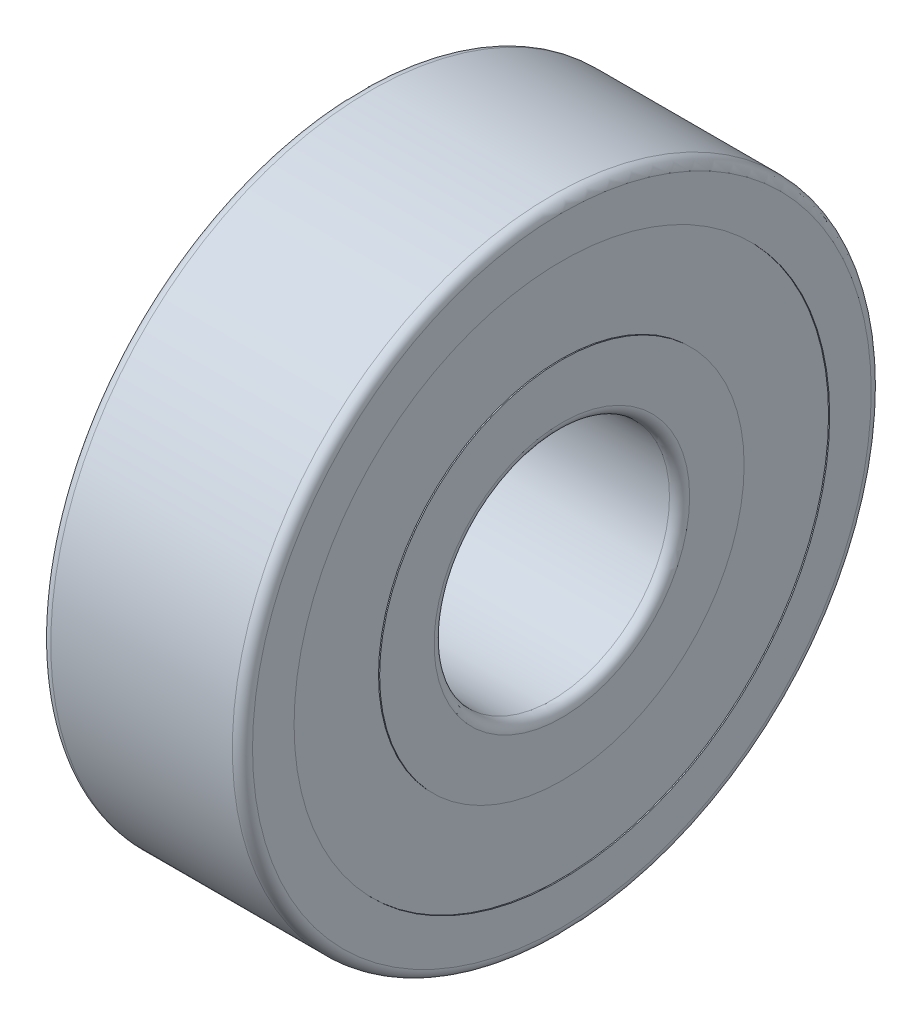
ISO-10303-21;
HEADER;
FILE_DESCRIPTION(('STEP AP214'),'2;1');
FILE_NAME('part.step','',(''),(''),'','','');
FILE_SCHEMA(('AUTOMOTIVE_DESIGN { 1 0 10303 214 1 1 1 1 }'));
ENDSEC;
DATA;
#1=APPLICATION_CONTEXT('core data for automotive mechanical design processes');
#2=APPLICATION_PROTOCOL_DEFINITION('international standard','automotive_design',2000,#1);
#3=PRODUCT_CONTEXT('',#1,'mechanical');
#4=PRODUCT('Part','Part','',(#3));
#5=PRODUCT_RELATED_PRODUCT_CATEGORY('part','',(#4));
#6=PRODUCT_DEFINITION_FORMATION('','',#4);
#7=PRODUCT_DEFINITION_CONTEXT('part definition',#1,'design');
#8=PRODUCT_DEFINITION('design','',#6,#7);
#9=PRODUCT_DEFINITION_SHAPE('','',#8);
#10=(LENGTH_UNIT() NAMED_UNIT(*) SI_UNIT(.MILLI.,.METRE.));
#11=(NAMED_UNIT(*) PLANE_ANGLE_UNIT() SI_UNIT($,.RADIAN.));
#12=(NAMED_UNIT(*) SI_UNIT($,.STERADIAN.) SOLID_ANGLE_UNIT());
#13=UNCERTAINTY_MEASURE_WITH_UNIT(LENGTH_MEASURE(1.E-05),#10,'distance_accuracy_value','');
#14=(GEOMETRIC_REPRESENTATION_CONTEXT(3) GLOBAL_UNCERTAINTY_ASSIGNED_CONTEXT((#13)) GLOBAL_UNIT_ASSIGNED_CONTEXT((#10,
#11,#12)) REPRESENTATION_CONTEXT('',''));
#15=CARTESIAN_POINT('',(0.,0.,0.));
#16=DIRECTION('',(0.,0.,1.));
#17=DIRECTION('',(1.,0.,0.));
#18=AXIS2_PLACEMENT_3D('',#15,#16,#17);
#19=CARTESIAN_POINT('',(3.,4.052683712082,-5.081904636042));
#20=DIRECTION('',(-1.,0.,0.));
#21=DIRECTION('',(0.,1.,0.));
#22=AXIS2_PLACEMENT_3D('',#19,#20,#21);
#23=SPHERICAL_SURFACE('',#22,1.776);
#24=CARTESIAN_POINT('',(4.776,4.052683712082,-5.081904636042));
#25=VERTEX_POINT('',#24);
#26=VERTEX_LOOP('',#25);
#27=FACE_BOUND('',#26,.T.);
#28=ADVANCED_FACE('P0_F15',(#27),#23,.T.);
#29=CLOSED_SHELL('',(#28));
#30=MANIFOLD_SOLID_BREP('P0_B1',#29);
#31=CARTESIAN_POINT('',(3.,-1.446386070716,-6.337031429182));
#32=DIRECTION('',(-1.,0.,0.));
#33=DIRECTION('',(0.,1.,0.));
#34=AXIS2_PLACEMENT_3D('',#31,#32,#33);
#35=SPHERICAL_SURFACE('',#34,1.776);
#36=CARTESIAN_POINT('',(4.776,-1.446386070716,-6.337031429182));
#37=VERTEX_POINT('',#36);
#38=VERTEX_LOOP('',#37);
#39=FACE_BOUND('',#38,.T.);
#40=ADVANCED_FACE('P1_F15',(#39),#35,.T.);
#41=CLOSED_SHELL('',(#40));
#42=MANIFOLD_SOLID_BREP('P1_B1',#41);
#43=CARTESIAN_POINT('',(3.,-5.856297641366,-2.820244304264));
#44=DIRECTION('',(-1.,0.,0.));
#45=DIRECTION('',(0.,1.,0.));
#46=AXIS2_PLACEMENT_3D('',#43,#44,#45);
#47=SPHERICAL_SURFACE('',#46,1.776);
#48=CARTESIAN_POINT('',(4.776,-5.856297641366,-2.820244304264));
#49=VERTEX_POINT('',#48);
#50=VERTEX_LOOP('',#49);
#51=FACE_BOUND('',#50,.T.);
#52=ADVANCED_FACE('P2_F15',(#51),#47,.T.);
#53=CLOSED_SHELL('',(#52));
#54=MANIFOLD_SOLID_BREP('P2_B1',#53);
#55=CARTESIAN_POINT('',(3.,-5.856297641366,2.820244304264));
#56=DIRECTION('',(-1.,0.,0.));
#57=DIRECTION('',(0.,1.,0.));
#58=AXIS2_PLACEMENT_3D('',#55,#56,#57);
#59=SPHERICAL_SURFACE('',#58,1.776);
#60=CARTESIAN_POINT('',(4.776,-5.856297641366,2.820244304264));
#61=VERTEX_POINT('',#60);
#62=VERTEX_LOOP('',#61);
#63=FACE_BOUND('',#62,.T.);
#64=ADVANCED_FACE('P3_F15',(#63),#59,.T.);
#65=CLOSED_SHELL('',(#64));
#66=MANIFOLD_SOLID_BREP('P3_B1',#65);
#67=CARTESIAN_POINT('',(3.,-1.446386070716,6.337031429182));
#68=DIRECTION('',(-1.,0.,0.));
#69=DIRECTION('',(0.,1.,0.));
#70=AXIS2_PLACEMENT_3D('',#67,#68,#69);
#71=SPHERICAL_SURFACE('',#70,1.776);
#72=CARTESIAN_POINT('',(4.776,-1.446386070716,6.337031429182));
#73=VERTEX_POINT('',#72);
#74=VERTEX_LOOP('',#73);
#75=FACE_BOUND('',#74,.T.);
#76=ADVANCED_FACE('P4_F15',(#75),#71,.T.);
#77=CLOSED_SHELL('',(#76));
#78=MANIFOLD_SOLID_BREP('P4_B1',#77);
#79=CARTESIAN_POINT('',(3.,4.052683712082,5.081904636042));
#80=DIRECTION('',(-1.,0.,0.));
#81=DIRECTION('',(0.,1.,0.));
#82=AXIS2_PLACEMENT_3D('',#79,#80,#81);
#83=SPHERICAL_SURFACE('',#82,1.776);
#84=CARTESIAN_POINT('',(4.776,4.052683712082,5.081904636042));
#85=VERTEX_POINT('',#84);
#86=VERTEX_LOOP('',#85);
#87=FACE_BOUND('',#86,.T.);
#88=ADVANCED_FACE('P5_F15',(#87),#83,.T.);
#89=CLOSED_SHELL('',(#88));
#90=MANIFOLD_SOLID_BREP('P5_B1',#89);
#91=CARTESIAN_POINT('',(3.,6.5,0.));
#92=DIRECTION('',(-1.,0.,0.));
#93=DIRECTION('',(0.,1.,0.));
#94=AXIS2_PLACEMENT_3D('',#91,#92,#93);
#95=SPHERICAL_SURFACE('',#94,1.776);
#96=CARTESIAN_POINT('',(4.776,6.5,0.));
#97=VERTEX_POINT('',#96);
#98=VERTEX_LOOP('',#97);
#99=FACE_BOUND('',#98,.T.);
#100=ADVANCED_FACE('P6_F15',(#99),#95,.T.);
#101=CLOSED_SHELL('',(#100));
#102=MANIFOLD_SOLID_BREP('P6_B1',#101);
#103=CARTESIAN_POINT('',(6.,0.,0.));
#104=DIRECTION('',(1.,0.,0.));
#105=DIRECTION('',(0.,0.,-1.));
#106=AXIS2_PLACEMENT_3D('',#103,#104,#105);
#107=CYLINDRICAL_SURFACE('',#106,5.42);
#108=CARTESIAN_POINT('',(1.59011489829845,0.,0.));
#109=DIRECTION('',(1.,0.,0.));
#110=DIRECTION('',(0.,0.,-1.));
#111=AXIS2_PLACEMENT_3D('',#108,#109,#110);
#112=CIRCLE('',#111,5.42);
#113=CARTESIAN_POINT('',(1.59011489829845,0.,-5.42));
#114=VERTEX_POINT('',#113);
#115=EDGE_CURVE('P7_E10',#114,#114,#112,.T.);
#116=ORIENTED_EDGE('',*,*,#115,.F.);
#117=EDGE_LOOP('',(#116));
#118=FACE_BOUND('',#117,.T.);
#119=CARTESIAN_POINT('',(0.,0.,0.));
#120=DIRECTION('',(1.,0.,0.));
#121=DIRECTION('',(0.,0.,-1.));
#122=AXIS2_PLACEMENT_3D('',#119,#120,#121);
#123=CIRCLE('',#122,5.42);
#124=CARTESIAN_POINT('',(0.,0.,-5.42));
#125=VERTEX_POINT('',#124);
#126=EDGE_CURVE('P7_E67',#125,#125,#123,.T.);
#127=ORIENTED_EDGE('',*,*,#126,.T.);
#128=EDGE_LOOP('',(#127));
#129=FACE_BOUND('',#128,.T.);
#130=ADVANCED_FACE('P7_F16',(#118,#129),#107,.T.);
#131=CARTESIAN_POINT('',(3.,0.,0.));
#132=DIRECTION('',(1.,0.,0.));
#133=DIRECTION('',(0.,0.,-1.));
#134=AXIS2_PLACEMENT_3D('',#131,#132,#133);
#135=TOROIDAL_SURFACE('',#134,6.5,1.776);
#136=ORIENTED_EDGE('',*,*,#115,.T.);
#137=EDGE_LOOP('',(#136));
#138=FACE_BOUND('',#137,.T.);
#139=CARTESIAN_POINT('',(4.40988510170155,0.,0.));
#140=DIRECTION('',(1.,0.,0.));
#141=DIRECTION('',(0.,0.,-1.));
#142=AXIS2_PLACEMENT_3D('',#139,#140,#141);
#143=CIRCLE('',#142,5.42);
#144=CARTESIAN_POINT('',(4.40988510170155,0.,-5.42));
#145=VERTEX_POINT('',#144);
#146=EDGE_CURVE('P7_E27',#145,#145,#143,.T.);
#147=ORIENTED_EDGE('',*,*,#146,.F.);
#148=EDGE_LOOP('',(#147));
#149=FACE_BOUND('',#148,.T.);
#150=ADVANCED_FACE('P7_F101',(#138,#149),#135,.F.);
#151=CARTESIAN_POINT('',(6.,0.,0.));
#152=DIRECTION('',(1.,0.,0.));
#153=DIRECTION('',(0.,0.,-1.));
#154=AXIS2_PLACEMENT_3D('',#151,#152,#153);
#155=CYLINDRICAL_SURFACE('',#154,5.42);
#156=CARTESIAN_POINT('',(6.,0.,0.));
#157=DIRECTION('',(1.,0.,0.));
#158=DIRECTION('',(0.,0.,-1.));
#159=AXIS2_PLACEMENT_3D('',#156,#157,#158);
#160=CIRCLE('',#159,5.42);
#161=CARTESIAN_POINT('',(6.,0.,-5.42));
#162=VERTEX_POINT('',#161);
#163=EDGE_CURVE('P7_E20',#162,#162,#160,.T.);
#164=ORIENTED_EDGE('',*,*,#163,.F.);
#165=EDGE_LOOP('',(#164));
#166=FACE_BOUND('',#165,.T.);
#167=ORIENTED_EDGE('',*,*,#146,.T.);
#168=EDGE_LOOP('',(#167));
#169=FACE_BOUND('',#168,.T.);
#170=ADVANCED_FACE('P7_F18',(#166,#169),#155,.T.);
#171=CARTESIAN_POINT('',(6.,3.8,0.));
#172=DIRECTION('',(1.,0.,0.));
#173=DIRECTION('',(0.,1.,0.));
#174=AXIS2_PLACEMENT_3D('',#171,#172,#173);
#175=PLANE('',#174);
#176=CARTESIAN_POINT('',(6.,0.,0.));
#177=DIRECTION('',(1.,0.,0.));
#178=DIRECTION('',(0.,0.,-1.));
#179=AXIS2_PLACEMENT_3D('',#176,#177,#178);
#180=CIRCLE('',#179,3.8);
#181=CARTESIAN_POINT('',(6.,0.,-3.8));
#182=VERTEX_POINT('',#181);
#183=EDGE_CURVE('P7_E83',#182,#182,#180,.T.);
#184=ORIENTED_EDGE('',*,*,#183,.F.);
#185=EDGE_LOOP('',(#184));
#186=FACE_BOUND('',#185,.T.);
#187=ORIENTED_EDGE('',*,*,#163,.T.);
#188=EDGE_LOOP('',(#187));
#189=FACE_BOUND('',#188,.T.);
#190=ADVANCED_FACE('P7_F110',(#186,#189),#175,.T.);
#191=CARTESIAN_POINT('',(5.7,0.,0.));
#192=DIRECTION('',(1.,0.,0.));
#193=DIRECTION('',(0.,0.,-1.));
#194=AXIS2_PLACEMENT_3D('',#191,#192,#193);
#195=TOROIDAL_SURFACE('',#194,3.8,0.3);
#196=CARTESIAN_POINT('',(5.7,0.,0.));
#197=DIRECTION('',(1.,0.,0.));
#198=DIRECTION('',(0.,0.,-1.));
#199=AXIS2_PLACEMENT_3D('',#196,#197,#198);
#200=CIRCLE('',#199,3.5);
#201=CARTESIAN_POINT('',(5.7,0.,-3.5));
#202=VERTEX_POINT('',#201);
#203=EDGE_CURVE('P7_E77',#202,#202,#200,.T.);
#204=ORIENTED_EDGE('',*,*,#203,.F.);
#205=EDGE_LOOP('',(#204));
#206=FACE_BOUND('',#205,.T.);
#207=ORIENTED_EDGE('',*,*,#183,.T.);
#208=EDGE_LOOP('',(#207));
#209=FACE_BOUND('',#208,.T.);
#210=ADVANCED_FACE('P7_F119',(#206,#209),#195,.T.);
#211=CARTESIAN_POINT('',(6.,0.,0.));
#212=DIRECTION('',(1.,0.,0.));
#213=DIRECTION('',(0.,0.,-1.));
#214=AXIS2_PLACEMENT_3D('',#211,#212,#213);
#215=CYLINDRICAL_SURFACE('',#214,3.5);
#216=CARTESIAN_POINT('',(0.3,0.,0.));
#217=DIRECTION('',(1.,0.,0.));
#218=DIRECTION('',(0.,0.,-1.));
#219=AXIS2_PLACEMENT_3D('',#216,#217,#218);
#220=CIRCLE('',#219,3.5);
#221=CARTESIAN_POINT('',(0.3,0.,-3.5));
#222=VERTEX_POINT('',#221);
#223=EDGE_CURVE('P7_E70',#222,#222,#220,.T.);
#224=ORIENTED_EDGE('',*,*,#223,.F.);
#225=EDGE_LOOP('',(#224));
#226=FACE_BOUND('',#225,.T.);
#227=ORIENTED_EDGE('',*,*,#203,.T.);
#228=EDGE_LOOP('',(#227));
#229=FACE_BOUND('',#228,.T.);
#230=ADVANCED_FACE('P7_F115',(#226,#229),#215,.F.);
#231=CARTESIAN_POINT('',(0.3,0.,0.));
#232=DIRECTION('',(1.,0.,0.));
#233=DIRECTION('',(0.,0.,-1.));
#234=AXIS2_PLACEMENT_3D('',#231,#232,#233);
#235=TOROIDAL_SURFACE('',#234,3.8,0.3);
#236=CARTESIAN_POINT('',(0.,0.,0.));
#237=DIRECTION('',(1.,0.,0.));
#238=DIRECTION('',(0.,0.,-1.));
#239=AXIS2_PLACEMENT_3D('',#236,#237,#238);
#240=CIRCLE('',#239,3.8);
#241=CARTESIAN_POINT('',(0.,0.,-3.8));
#242=VERTEX_POINT('',#241);
#243=EDGE_CURVE('P7_E60',#242,#242,#240,.T.);
#244=ORIENTED_EDGE('',*,*,#243,.F.);
#245=EDGE_LOOP('',(#244));
#246=FACE_BOUND('',#245,.T.);
#247=ORIENTED_EDGE('',*,*,#223,.T.);
#248=EDGE_LOOP('',(#247));
#249=FACE_BOUND('',#248,.T.);
#250=ADVANCED_FACE('P7_F118',(#246,#249),#235,.T.);
#251=CARTESIAN_POINT('',(0.,5.42,0.));
#252=DIRECTION('',(-1.,0.,0.));
#253=DIRECTION('',(0.,0.,1.));
#254=AXIS2_PLACEMENT_3D('',#251,#252,#253);
#255=PLANE('',#254);
#256=ORIENTED_EDGE('',*,*,#126,.F.);
#257=EDGE_LOOP('',(#256));
#258=FACE_BOUND('',#257,.T.);
#259=ORIENTED_EDGE('',*,*,#243,.T.);
#260=EDGE_LOOP('',(#259));
#261=FACE_BOUND('',#260,.T.);
#262=ADVANCED_FACE('P7_F127',(#258,#261),#255,.T.);
#263=CLOSED_SHELL('',(#130,#150,#170,#190,#210,#230,#250,#262));
#264=MANIFOLD_SOLID_BREP('P7_B1',#263);
#265=CARTESIAN_POINT('',(0.3,0.,0.));
#266=DIRECTION('',(1.,0.,0.));
#267=DIRECTION('',(0.,0.,-1.));
#268=AXIS2_PLACEMENT_3D('',#265,#266,#267);
#269=TOROIDAL_SURFACE('',#268,9.2,0.3);
#270=CARTESIAN_POINT('',(0.3,0.,0.));
#271=DIRECTION('',(1.,0.,0.));
#272=DIRECTION('',(0.,0.,-1.));
#273=AXIS2_PLACEMENT_3D('',#270,#271,#272);
#274=CIRCLE('',#273,9.5);
#275=CARTESIAN_POINT('',(0.3,0.,-9.5));
#276=VERTEX_POINT('',#275);
#277=EDGE_CURVE('P8_E11',#276,#276,#274,.T.);
#278=ORIENTED_EDGE('',*,*,#277,.F.);
#279=EDGE_LOOP('',(#278));
#280=FACE_BOUND('',#279,.T.);
#281=CARTESIAN_POINT('',(0.,0.,0.));
#282=DIRECTION('',(1.,0.,0.));
#283=DIRECTION('',(0.,0.,-1.));
#284=AXIS2_PLACEMENT_3D('',#281,#282,#283);
#285=CIRCLE('',#284,9.2);
#286=CARTESIAN_POINT('',(0.,0.,-9.2));
#287=VERTEX_POINT('',#286);
#288=EDGE_CURVE('P8_E170',#287,#287,#285,.T.);
#289=ORIENTED_EDGE('',*,*,#288,.T.);
#290=EDGE_LOOP('',(#289));
#291=FACE_BOUND('',#290,.T.);
#292=ADVANCED_FACE('P8_F17',(#280,#291),#269,.T.);
#293=CARTESIAN_POINT('',(6.,0.,0.));
#294=DIRECTION('',(1.,0.,0.));
#295=DIRECTION('',(0.,0.,-1.));
#296=AXIS2_PLACEMENT_3D('',#293,#294,#295);
#297=CYLINDRICAL_SURFACE('',#296,9.5);
#298=CARTESIAN_POINT('',(5.7,0.,0.));
#299=DIRECTION('',(1.,0.,0.));
#300=DIRECTION('',(0.,0.,-1.));
#301=AXIS2_PLACEMENT_3D('',#298,#299,#300);
#302=CIRCLE('',#301,9.5);
#303=CARTESIAN_POINT('',(5.7,0.,-9.5));
#304=VERTEX_POINT('',#303);
#305=EDGE_CURVE('P8_E28',#304,#304,#302,.T.);
#306=ORIENTED_EDGE('',*,*,#305,.F.);
#307=EDGE_LOOP('',(#306));
#308=FACE_BOUND('',#307,.T.);
#309=ORIENTED_EDGE('',*,*,#277,.T.);
#310=EDGE_LOOP('',(#309));
#311=FACE_BOUND('',#310,.T.);
#312=ADVANCED_FACE('P8_F115',(#308,#311),#297,.T.);
#313=CARTESIAN_POINT('',(5.7,0.,0.));
#314=DIRECTION('',(1.,0.,0.));
#315=DIRECTION('',(0.,0.,-1.));
#316=AXIS2_PLACEMENT_3D('',#313,#314,#315);
#317=TOROIDAL_SURFACE('',#316,9.2,0.300000000000004);
#318=CARTESIAN_POINT('',(6.,0.,0.));
#319=DIRECTION('',(1.,0.,0.));
#320=DIRECTION('',(0.,0.,-1.));
#321=AXIS2_PLACEMENT_3D('',#318,#319,#320);
#322=CIRCLE('',#321,9.2);
#323=CARTESIAN_POINT('',(6.,0.,-9.2));
#324=VERTEX_POINT('',#323);
#325=EDGE_CURVE('P8_E83',#324,#324,#322,.T.);
#326=ORIENTED_EDGE('',*,*,#325,.F.);
#327=EDGE_LOOP('',(#326));
#328=FACE_BOUND('',#327,.T.);
#329=ORIENTED_EDGE('',*,*,#305,.T.);
#330=EDGE_LOOP('',(#329));
#331=FACE_BOUND('',#330,.T.);
#332=ADVANCED_FACE('P8_F19',(#328,#331),#317,.T.);
#333=CARTESIAN_POINT('',(6.,7.964,0.));
#334=DIRECTION('',(1.,0.,0.));
#335=DIRECTION('',(0.,1.,0.));
#336=AXIS2_PLACEMENT_3D('',#333,#334,#335);
#337=PLANE('',#336);
#338=CARTESIAN_POINT('',(6.,0.,0.));
#339=DIRECTION('',(1.,0.,0.));
#340=DIRECTION('',(0.,0.,-1.));
#341=AXIS2_PLACEMENT_3D('',#338,#339,#340);
#342=CIRCLE('',#341,7.964);
#343=CARTESIAN_POINT('',(6.,0.,-7.964));
#344=VERTEX_POINT('',#343);
#345=EDGE_CURVE('P8_E89',#344,#344,#342,.T.);
#346=ORIENTED_EDGE('',*,*,#345,.F.);
#347=EDGE_LOOP('',(#346));
#348=FACE_BOUND('',#347,.T.);
#349=ORIENTED_EDGE('',*,*,#325,.T.);
#350=EDGE_LOOP('',(#349));
#351=FACE_BOUND('',#350,.T.);
#352=ADVANCED_FACE('P8_F124',(#348,#351),#337,.T.);
#353=CARTESIAN_POINT('',(6.,0.,0.));
#354=DIRECTION('',(1.,0.,0.));
#355=DIRECTION('',(0.,0.,-1.));
#356=AXIS2_PLACEMENT_3D('',#353,#354,#355);
#357=CYLINDRICAL_SURFACE('',#356,7.964);
#358=CARTESIAN_POINT('',(5.865,0.,0.));
#359=DIRECTION('',(1.,0.,0.));
#360=DIRECTION('',(0.,0.,-1.));
#361=AXIS2_PLACEMENT_3D('',#358,#359,#360);
#362=CIRCLE('',#361,7.964);
#363=CARTESIAN_POINT('',(5.865,0.,-7.964));
#364=VERTEX_POINT('',#363);
#365=EDGE_CURVE('P8_E93',#364,#364,#362,.T.);
#366=ORIENTED_EDGE('',*,*,#365,.F.);
#367=EDGE_LOOP('',(#366));
#368=FACE_BOUND('',#367,.T.);
#369=ORIENTED_EDGE('',*,*,#345,.T.);
#370=EDGE_LOOP('',(#369));
#371=FACE_BOUND('',#370,.T.);
#372=ADVANCED_FACE('P8_F90',(#368,#371),#357,.F.);
#373=CARTESIAN_POINT('',(5.865,7.58,0.));
#374=DIRECTION('',(1.,0.,0.));
#375=DIRECTION('',(0.,1.,0.));
#376=AXIS2_PLACEMENT_3D('',#373,#374,#375);
#377=PLANE('',#376);
#378=CARTESIAN_POINT('',(5.865,0.,0.));
#379=DIRECTION('',(1.,0.,0.));
#380=DIRECTION('',(0.,0.,-1.));
#381=AXIS2_PLACEMENT_3D('',#378,#379,#380);
#382=CIRCLE('',#381,7.58);
#383=CARTESIAN_POINT('',(5.865,0.,-7.58));
#384=VERTEX_POINT('',#383);
#385=EDGE_CURVE('P8_E63',#384,#384,#382,.T.);
#386=ORIENTED_EDGE('',*,*,#385,.F.);
#387=EDGE_LOOP('',(#386));
#388=FACE_BOUND('',#387,.T.);
#389=ORIENTED_EDGE('',*,*,#365,.T.);
#390=EDGE_LOOP('',(#389));
#391=FACE_BOUND('',#390,.T.);
#392=ADVANCED_FACE('P8_F139',(#388,#391),#377,.T.);
#393=CARTESIAN_POINT('',(6.,0.,0.));
#394=DIRECTION('',(1.,0.,0.));
#395=DIRECTION('',(0.,0.,-1.));
#396=AXIS2_PLACEMENT_3D('',#393,#394,#395);
#397=CYLINDRICAL_SURFACE('',#396,7.58);
#398=CARTESIAN_POINT('',(4.40988510170155,0.,0.));
#399=DIRECTION('',(1.,0.,0.));
#400=DIRECTION('',(0.,0.,-1.));
#401=AXIS2_PLACEMENT_3D('',#398,#399,#400);
#402=CIRCLE('',#401,7.58);
#403=CARTESIAN_POINT('',(4.40988510170155,0.,-7.58));
#404=VERTEX_POINT('',#403);
#405=EDGE_CURVE('P8_E74',#404,#404,#402,.T.);
#406=ORIENTED_EDGE('',*,*,#405,.F.);
#407=EDGE_LOOP('',(#406));
#408=FACE_BOUND('',#407,.T.);
#409=ORIENTED_EDGE('',*,*,#385,.T.);
#410=EDGE_LOOP('',(#409));
#411=FACE_BOUND('',#410,.T.);
#412=ADVANCED_FACE('P8_F136',(#408,#411),#397,.F.);
#413=CARTESIAN_POINT('',(3.,0.,0.));
#414=DIRECTION('',(1.,0.,0.));
#415=DIRECTION('',(0.,0.,-1.));
#416=AXIS2_PLACEMENT_3D('',#413,#414,#415);
#417=TOROIDAL_SURFACE('',#416,6.5,1.776);
#418=ORIENTED_EDGE('',*,*,#405,.T.);
#419=EDGE_LOOP('',(#418));
#420=FACE_BOUND('',#419,.T.);
#421=CARTESIAN_POINT('',(1.59011489829845,0.,0.));
#422=DIRECTION('',(1.,0.,0.));
#423=DIRECTION('',(0.,0.,-1.));
#424=AXIS2_PLACEMENT_3D('',#421,#422,#423);
#425=CIRCLE('',#424,7.58);
#426=CARTESIAN_POINT('',(1.59011489829845,0.,-7.58));
#427=VERTEX_POINT('',#426);
#428=EDGE_CURVE('P8_E104',#427,#427,#425,.T.);
#429=ORIENTED_EDGE('',*,*,#428,.F.);
#430=EDGE_LOOP('',(#429));
#431=FACE_BOUND('',#430,.T.);
#432=ADVANCED_FACE('P8_F132',(#420,#431),#417,.F.);
#433=CARTESIAN_POINT('',(6.,0.,0.));
#434=DIRECTION('',(1.,0.,0.));
#435=DIRECTION('',(0.,0.,-1.));
#436=AXIS2_PLACEMENT_3D('',#433,#434,#435);
#437=CYLINDRICAL_SURFACE('',#436,7.58);
#438=CARTESIAN_POINT('',(0.135,0.,0.));
#439=DIRECTION('',(1.,0.,0.));
#440=DIRECTION('',(0.,0.,-1.));
#441=AXIS2_PLACEMENT_3D('',#438,#439,#440);
#442=CIRCLE('',#441,7.58);
#443=CARTESIAN_POINT('',(0.135,0.,-7.58));
#444=VERTEX_POINT('',#443);
#445=EDGE_CURVE('P8_E107',#444,#444,#442,.T.);
#446=ORIENTED_EDGE('',*,*,#445,.F.);
#447=EDGE_LOOP('',(#446));
#448=FACE_BOUND('',#447,.T.);
#449=ORIENTED_EDGE('',*,*,#428,.T.);
#450=EDGE_LOOP('',(#449));
#451=FACE_BOUND('',#450,.T.);
#452=ADVANCED_FACE('P8_F135',(#448,#451),#437,.F.);
#453=CARTESIAN_POINT('',(0.135,7.964,0.));
#454=DIRECTION('',(-1.,0.,0.));
#455=DIRECTION('',(0.,0.,1.));
#456=AXIS2_PLACEMENT_3D('',#453,#454,#455);
#457=PLANE('',#456);
#458=CARTESIAN_POINT('',(0.135,0.,0.));
#459=DIRECTION('',(1.,0.,0.));
#460=DIRECTION('',(0.,0.,-1.));
#461=AXIS2_PLACEMENT_3D('',#458,#459,#460);
#462=CIRCLE('',#461,7.964);
#463=CARTESIAN_POINT('',(0.135,0.,-7.964));
#464=VERTEX_POINT('',#463);
#465=EDGE_CURVE('P8_E21',#464,#464,#462,.T.);
#466=ORIENTED_EDGE('',*,*,#465,.F.);
#467=EDGE_LOOP('',(#466));
#468=FACE_BOUND('',#467,.T.);
#469=ORIENTED_EDGE('',*,*,#445,.T.);
#470=EDGE_LOOP('',(#469));
#471=FACE_BOUND('',#470,.T.);
#472=ADVANCED_FACE('P8_F141',(#468,#471),#457,.T.);
#473=CARTESIAN_POINT('',(6.,0.,0.));
#474=DIRECTION('',(1.,0.,0.));
#475=DIRECTION('',(0.,0.,-1.));
#476=AXIS2_PLACEMENT_3D('',#473,#474,#475);
#477=CYLINDRICAL_SURFACE('',#476,7.964);
#478=CARTESIAN_POINT('',(0.,0.,0.));
#479=DIRECTION('',(1.,0.,0.));
#480=DIRECTION('',(0.,0.,-1.));
#481=AXIS2_PLACEMENT_3D('',#478,#479,#480);
#482=CIRCLE('',#481,7.964);
#483=CARTESIAN_POINT('',(0.,0.,-7.964));
#484=VERTEX_POINT('',#483);
#485=EDGE_CURVE('P8_E265',#484,#484,#482,.T.);
#486=ORIENTED_EDGE('',*,*,#485,.F.);
#487=EDGE_LOOP('',(#486));
#488=FACE_BOUND('',#487,.T.);
#489=ORIENTED_EDGE('',*,*,#465,.T.);
#490=EDGE_LOOP('',(#489));
#491=FACE_BOUND('',#490,.T.);
#492=ADVANCED_FACE('P8_F130',(#488,#491),#477,.F.);
#493=CARTESIAN_POINT('',(0.,9.2,0.));
#494=DIRECTION('',(-1.,0.,0.));
#495=DIRECTION('',(0.,0.,1.));
#496=AXIS2_PLACEMENT_3D('',#493,#494,#495);
#497=PLANE('',#496);
#498=ORIENTED_EDGE('',*,*,#288,.F.);
#499=EDGE_LOOP('',(#498));
#500=FACE_BOUND('',#499,.T.);
#501=ORIENTED_EDGE('',*,*,#485,.T.);
#502=EDGE_LOOP('',(#501));
#503=FACE_BOUND('',#502,.T.);
#504=ADVANCED_FACE('P8_F196',(#500,#503),#497,.T.);
#505=CLOSED_SHELL('',(#292,#312,#332,#352,#372,#392,#412,#432,#452,#472,#492,#504));
#506=MANIFOLD_SOLID_BREP('P8_B1',#505);
#507=CARTESIAN_POINT('',(5.967,5.42,0.));
#508=DIRECTION('',(1.,0.,0.));
#509=DIRECTION('',(0.,1.,0.));
#510=AXIS2_PLACEMENT_3D('',#507,#508,#509);
#511=PLANE('',#510);
#512=CARTESIAN_POINT('',(5.967,0.,0.));
#513=DIRECTION('',(1.,0.,0.));
#514=DIRECTION('',(0.,0.,-1.));
#515=AXIS2_PLACEMENT_3D('',#512,#513,#514);
#516=CIRCLE('',#515,5.42);
#517=CARTESIAN_POINT('',(5.967,0.,-5.42));
#518=VERTEX_POINT('',#517);
#519=EDGE_CURVE('P9_E11',#518,#518,#516,.T.);
#520=ORIENTED_EDGE('',*,*,#519,.F.);
#521=EDGE_LOOP('',(#520));
#522=FACE_BOUND('',#521,.T.);
#523=CARTESIAN_POINT('',(5.967,0.,0.));
#524=DIRECTION('',(1.,0.,0.));
#525=DIRECTION('',(0.,0.,-1.));
#526=AXIS2_PLACEMENT_3D('',#523,#524,#525);
#527=CIRCLE('',#526,7.964);
#528=CARTESIAN_POINT('',(5.967,0.,-7.964));
#529=VERTEX_POINT('',#528);
#530=EDGE_CURVE('P9_E46',#529,#529,#527,.T.);
#531=ORIENTED_EDGE('',*,*,#530,.T.);
#532=EDGE_LOOP('',(#531));
#533=FACE_BOUND('',#532,.T.);
#534=ADVANCED_FACE('P9_F17',(#522,#533),#511,.T.);
#535=CARTESIAN_POINT('',(5.967,0.,0.));
#536=DIRECTION('',(1.,0.,0.));
#537=DIRECTION('',(0.,0.,-1.));
#538=AXIS2_PLACEMENT_3D('',#535,#536,#537);
#539=CYLINDRICAL_SURFACE('',#538,5.42);
#540=CARTESIAN_POINT('',(5.865,0.,0.));
#541=DIRECTION('',(1.,0.,0.));
#542=DIRECTION('',(0.,0.,-1.));
#543=AXIS2_PLACEMENT_3D('',#540,#541,#542);
#544=CIRCLE('',#543,5.42);
#545=CARTESIAN_POINT('',(5.865,0.,-5.42));
#546=VERTEX_POINT('',#545);
#547=EDGE_CURVE('P9_E21',#546,#546,#544,.T.);
#548=ORIENTED_EDGE('',*,*,#547,.F.);
#549=EDGE_LOOP('',(#548));
#550=FACE_BOUND('',#549,.T.);
#551=ORIENTED_EDGE('',*,*,#519,.T.);
#552=EDGE_LOOP('',(#551));
#553=FACE_BOUND('',#552,.T.);
#554=ADVANCED_FACE('P9_F69',(#550,#553),#539,.F.);
#555=CARTESIAN_POINT('',(5.865,7.964,0.));
#556=DIRECTION('',(-1.,0.,0.));
#557=DIRECTION('',(0.,0.,1.));
#558=AXIS2_PLACEMENT_3D('',#555,#556,#557);
#559=PLANE('',#558);
#560=CARTESIAN_POINT('',(5.865,0.,0.));
#561=DIRECTION('',(1.,0.,0.));
#562=DIRECTION('',(0.,0.,-1.));
#563=AXIS2_PLACEMENT_3D('',#560,#561,#562);
#564=CIRCLE('',#563,7.964);
#565=CARTESIAN_POINT('',(5.865,0.,-7.964));
#566=VERTEX_POINT('',#565);
#567=EDGE_CURVE('P9_E52',#566,#566,#564,.T.);
#568=ORIENTED_EDGE('',*,*,#567,.F.);
#569=EDGE_LOOP('',(#568));
#570=FACE_BOUND('',#569,.T.);
#571=ORIENTED_EDGE('',*,*,#547,.T.);
#572=EDGE_LOOP('',(#571));
#573=FACE_BOUND('',#572,.T.);
#574=ADVANCED_FACE('P9_F19',(#570,#573),#559,.T.);
#575=CARTESIAN_POINT('',(5.967,0.,0.));
#576=DIRECTION('',(1.,0.,0.));
#577=DIRECTION('',(0.,0.,-1.));
#578=AXIS2_PLACEMENT_3D('',#575,#576,#577);
#579=CYLINDRICAL_SURFACE('',#578,7.964);
#580=ORIENTED_EDGE('',*,*,#530,.F.);
#581=EDGE_LOOP('',(#580));
#582=FACE_BOUND('',#581,.T.);
#583=ORIENTED_EDGE('',*,*,#567,.T.);
#584=EDGE_LOOP('',(#583));
#585=FACE_BOUND('',#584,.T.);
#586=ADVANCED_FACE('P9_F53',(#582,#585),#579,.T.);
#587=CLOSED_SHELL('',(#534,#554,#574,#586));
#588=MANIFOLD_SOLID_BREP('P9_B1',#587);
#589=CARTESIAN_POINT('',(0.033,-5.42,0.));
#590=DIRECTION('',(-1.,0.,0.));
#591=DIRECTION('',(0.,-1.,0.));
#592=AXIS2_PLACEMENT_3D('',#589,#590,#591);
#593=PLANE('',#592);
#594=CARTESIAN_POINT('',(0.033,0.,0.));
#595=DIRECTION('',(-1.,0.,0.));
#596=DIRECTION('',(0.,0.,-1.));
#597=AXIS2_PLACEMENT_3D('',#594,#595,#596);
#598=CIRCLE('',#597,5.42);
#599=CARTESIAN_POINT('',(0.033,0.,-5.42));
#600=VERTEX_POINT('',#599);
#601=EDGE_CURVE('P10_E11',#600,#600,#598,.T.);
#602=ORIENTED_EDGE('',*,*,#601,.F.);
#603=EDGE_LOOP('',(#602));
#604=FACE_BOUND('',#603,.T.);
#605=CARTESIAN_POINT('',(0.033,0.,0.));
#606=DIRECTION('',(-1.,0.,0.));
#607=DIRECTION('',(0.,0.,-1.));
#608=AXIS2_PLACEMENT_3D('',#605,#606,#607);
#609=CIRCLE('',#608,7.964);
#610=CARTESIAN_POINT('',(0.033,0.,-7.964));
#611=VERTEX_POINT('',#610);
#612=EDGE_CURVE('P10_E46',#611,#611,#609,.T.);
#613=ORIENTED_EDGE('',*,*,#612,.T.);
#614=EDGE_LOOP('',(#613));
#615=FACE_BOUND('',#614,.T.);
#616=ADVANCED_FACE('P10_F17',(#604,#615),#593,.T.);
#617=CARTESIAN_POINT('',(0.033,0.,0.));
#618=DIRECTION('',(-1.,0.,0.));
#619=DIRECTION('',(0.,0.,-1.));
#620=AXIS2_PLACEMENT_3D('',#617,#618,#619);
#621=CYLINDRICAL_SURFACE('',#620,5.42);
#622=CARTESIAN_POINT('',(0.135,0.,0.));
#623=DIRECTION('',(-1.,0.,0.));
#624=DIRECTION('',(0.,0.,-1.));
#625=AXIS2_PLACEMENT_3D('',#622,#623,#624);
#626=CIRCLE('',#625,5.42);
#627=CARTESIAN_POINT('',(0.135,0.,-5.42));
#628=VERTEX_POINT('',#627);
#629=EDGE_CURVE('P10_E21',#628,#628,#626,.T.);
#630=ORIENTED_EDGE('',*,*,#629,.F.);
#631=EDGE_LOOP('',(#630));
#632=FACE_BOUND('',#631,.T.);
#633=ORIENTED_EDGE('',*,*,#601,.T.);
#634=EDGE_LOOP('',(#633));
#635=FACE_BOUND('',#634,.T.);
#636=ADVANCED_FACE('P10_F69',(#632,#635),#621,.F.);
#637=CARTESIAN_POINT('',(0.135,-7.964,0.));
#638=DIRECTION('',(1.,0.,0.));
#639=DIRECTION('',(0.,0.,1.));
#640=AXIS2_PLACEMENT_3D('',#637,#638,#639);
#641=PLANE('',#640);
#642=CARTESIAN_POINT('',(0.135,0.,0.));
#643=DIRECTION('',(-1.,0.,0.));
#644=DIRECTION('',(0.,0.,-1.));
#645=AXIS2_PLACEMENT_3D('',#642,#643,#644);
#646=CIRCLE('',#645,7.964);
#647=CARTESIAN_POINT('',(0.135,0.,-7.964));
#648=VERTEX_POINT('',#647);
#649=EDGE_CURVE('P10_E52',#648,#648,#646,.T.);
#650=ORIENTED_EDGE('',*,*,#649,.F.);
#651=EDGE_LOOP('',(#650));
#652=FACE_BOUND('',#651,.T.);
#653=ORIENTED_EDGE('',*,*,#629,.T.);
#654=EDGE_LOOP('',(#653));
#655=FACE_BOUND('',#654,.T.);
#656=ADVANCED_FACE('P10_F19',(#652,#655),#641,.T.);
#657=CARTESIAN_POINT('',(0.033,0.,0.));
#658=DIRECTION('',(-1.,0.,0.));
#659=DIRECTION('',(0.,0.,-1.));
#660=AXIS2_PLACEMENT_3D('',#657,#658,#659);
#661=CYLINDRICAL_SURFACE('',#660,7.964);
#662=ORIENTED_EDGE('',*,*,#612,.F.);
#663=EDGE_LOOP('',(#662));
#664=FACE_BOUND('',#663,.T.);
#665=ORIENTED_EDGE('',*,*,#649,.T.);
#666=EDGE_LOOP('',(#665));
#667=FACE_BOUND('',#666,.T.);
#668=ADVANCED_FACE('P10_F53',(#664,#667),#661,.T.);
#669=CLOSED_SHELL('',(#616,#636,#656,#668));
#670=MANIFOLD_SOLID_BREP('P10_B1',#669);
#671=ADVANCED_BREP_SHAPE_REPRESENTATION('',(#18,#30,#42,#54,#66,#78,#90,#102,#264,#506,#588,
#670),#14);
#672=SHAPE_DEFINITION_REPRESENTATION(#9,#671);
ENDSEC;
END-ISO-10303-21;
